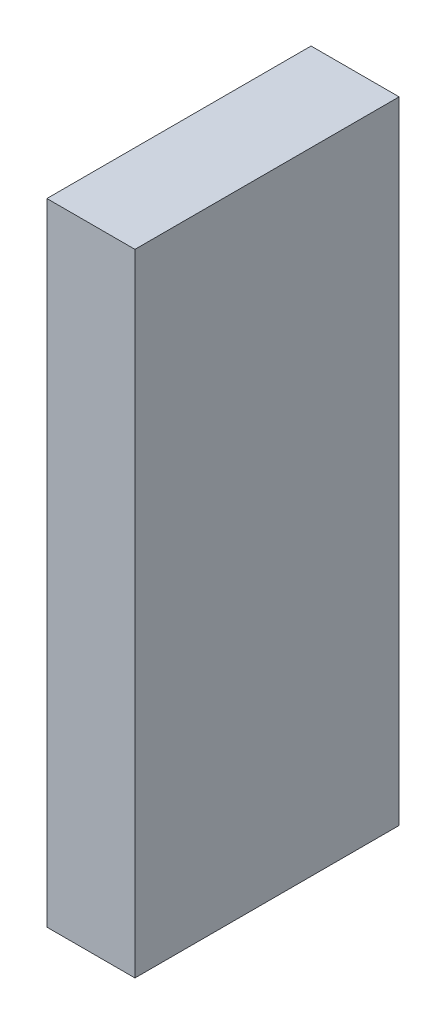
ISO-10303-21;
HEADER;
FILE_DESCRIPTION(('STEP AP214'),'2;1');
FILE_NAME('part.step','',(''),(''),'','','');
FILE_SCHEMA(('AUTOMOTIVE_DESIGN { 1 0 10303 214 1 1 1 1 }'));
ENDSEC;
DATA;
#1=APPLICATION_CONTEXT('core data for automotive mechanical design processes');
#2=APPLICATION_PROTOCOL_DEFINITION('international standard','automotive_design',2000,#1);
#3=PRODUCT_CONTEXT('',#1,'mechanical');
#4=PRODUCT('Part','Part','',(#3));
#5=PRODUCT_RELATED_PRODUCT_CATEGORY('part','',(#4));
#6=PRODUCT_DEFINITION_FORMATION('','',#4);
#7=PRODUCT_DEFINITION_CONTEXT('part definition',#1,'design');
#8=PRODUCT_DEFINITION('design','',#6,#7);
#9=PRODUCT_DEFINITION_SHAPE('','',#8);
#10=(LENGTH_UNIT() NAMED_UNIT(*) SI_UNIT(.MILLI.,.METRE.));
#11=(NAMED_UNIT(*) PLANE_ANGLE_UNIT() SI_UNIT($,.RADIAN.));
#12=(NAMED_UNIT(*) SI_UNIT($,.STERADIAN.) SOLID_ANGLE_UNIT());
#13=UNCERTAINTY_MEASURE_WITH_UNIT(LENGTH_MEASURE(1.E-05),#10,'distance_accuracy_value','');
#14=(GEOMETRIC_REPRESENTATION_CONTEXT(3) GLOBAL_UNCERTAINTY_ASSIGNED_CONTEXT((#13)) GLOBAL_UNIT_ASSIGNED_CONTEXT((#10,
#11,#12)) REPRESENTATION_CONTEXT('',''));
#15=CARTESIAN_POINT('',(0.,0.,0.));
#16=DIRECTION('',(0.,0.,1.));
#17=DIRECTION('',(1.,0.,0.));
#18=AXIS2_PLACEMENT_3D('',#15,#16,#17);
#19=CARTESIAN_POINT('',(15.,107.5,-45.));
#20=DIRECTION('',(-1.,0.,0.));
#21=DIRECTION('',(0.,0.,1.));
#22=AXIS2_PLACEMENT_3D('',#19,#20,#21);
#23=PLANE('',#22);
#24=DIRECTION('',(0.,0.,-1.));
#25=VECTOR('',#24,1.);
#26=CARTESIAN_POINT('',(15.,-107.5,-45.));
#27=LINE('',#26,#25);
#28=CARTESIAN_POINT('',(15.,-107.5,45.));
#29=VERTEX_POINT('',#28);
#30=CARTESIAN_POINT('',(15.,-107.5,-45.));
#31=VERTEX_POINT('',#30);
#32=EDGE_CURVE('E96',#29,#31,#27,.T.);
#33=ORIENTED_EDGE('',*,*,#32,.T.);
#34=DIRECTION('',(0.,-1.,0.));
#35=VECTOR('',#34,1.);
#36=CARTESIAN_POINT('',(15.,107.5,-45.));
#37=LINE('',#36,#35);
#38=CARTESIAN_POINT('',(15.,107.5,-45.));
#39=VERTEX_POINT('',#38);
#40=EDGE_CURVE('E11',#39,#31,#37,.T.);
#41=ORIENTED_EDGE('',*,*,#40,.F.);
#42=DIRECTION('',(0.,0.,-1.));
#43=VECTOR('',#42,1.);
#44=CARTESIAN_POINT('',(15.,107.5,-45.));
#45=LINE('',#44,#43);
#46=CARTESIAN_POINT('',(15.,107.5,45.));
#47=VERTEX_POINT('',#46);
#48=EDGE_CURVE('E84',#47,#39,#45,.T.);
#49=ORIENTED_EDGE('',*,*,#48,.F.);
#50=DIRECTION('',(0.,-1.,0.));
#51=VECTOR('',#50,1.);
#52=CARTESIAN_POINT('',(15.,107.5,45.));
#53=LINE('',#52,#51);
#54=EDGE_CURVE('E92',#47,#29,#53,.T.);
#55=ORIENTED_EDGE('',*,*,#54,.T.);
#56=EDGE_LOOP('',(#33,#41,#49,#55));
#57=FACE_BOUND('',#56,.T.);
#58=ADVANCED_FACE('F33',(#57),#23,.F.);
#59=CARTESIAN_POINT('',(-15.,107.5,-45.));
#60=DIRECTION('',(0.,0.,1.));
#61=DIRECTION('',(1.,0.,0.));
#62=AXIS2_PLACEMENT_3D('',#59,#60,#61);
#63=PLANE('',#62);
#64=DIRECTION('',(-1.,0.,0.));
#65=VECTOR('',#64,1.);
#66=CARTESIAN_POINT('',(-15.,-107.5,-45.));
#67=LINE('',#66,#65);
#68=CARTESIAN_POINT('',(-15.,-107.5,-45.));
#69=VERTEX_POINT('',#68);
#70=EDGE_CURVE('E88',#31,#69,#67,.T.);
#71=ORIENTED_EDGE('',*,*,#70,.T.);
#72=DIRECTION('',(0.,-1.,0.));
#73=VECTOR('',#72,1.);
#74=CARTESIAN_POINT('',(-15.,107.5,-45.));
#75=LINE('',#74,#73);
#76=CARTESIAN_POINT('',(-15.,107.5,-45.));
#77=VERTEX_POINT('',#76);
#78=EDGE_CURVE('E41',#77,#69,#75,.T.);
#79=ORIENTED_EDGE('',*,*,#78,.F.);
#80=DIRECTION('',(-1.,0.,0.));
#81=VECTOR('',#80,1.);
#82=CARTESIAN_POINT('',(-15.,107.5,-45.));
#83=LINE('',#82,#81);
#84=EDGE_CURVE('E79',#39,#77,#83,.T.);
#85=ORIENTED_EDGE('',*,*,#84,.F.);
#86=ORIENTED_EDGE('',*,*,#40,.T.);
#87=EDGE_LOOP('',(#71,#79,#85,#86));
#88=FACE_BOUND('',#87,.T.);
#89=ADVANCED_FACE('F87',(#88),#63,.F.);
#90=CARTESIAN_POINT('',(-15.,107.5,-45.));
#91=DIRECTION('',(1.,0.,0.));
#92=DIRECTION('',(0.,0.,-1.));
#93=AXIS2_PLACEMENT_3D('',#90,#91,#92);
#94=PLANE('',#93);
#95=DIRECTION('',(0.,0.,1.));
#96=VECTOR('',#95,1.);
#97=CARTESIAN_POINT('',(-15.,-107.5,-45.));
#98=LINE('',#97,#96);
#99=CARTESIAN_POINT('',(-15.,-107.5,45.));
#100=VERTEX_POINT('',#99);
#101=EDGE_CURVE('E66',#69,#100,#98,.T.);
#102=ORIENTED_EDGE('',*,*,#101,.T.);
#103=DIRECTION('',(0.,-1.,0.));
#104=VECTOR('',#103,1.);
#105=CARTESIAN_POINT('',(-15.,107.5,45.));
#106=LINE('',#105,#104);
#107=CARTESIAN_POINT('',(-15.,107.5,45.));
#108=VERTEX_POINT('',#107);
#109=EDGE_CURVE('E89',#108,#100,#106,.T.);
#110=ORIENTED_EDGE('',*,*,#109,.F.);
#111=DIRECTION('',(0.,0.,1.));
#112=VECTOR('',#111,1.);
#113=CARTESIAN_POINT('',(-15.,107.5,-45.));
#114=LINE('',#113,#112);
#115=EDGE_CURVE('E82',#77,#108,#114,.T.);
#116=ORIENTED_EDGE('',*,*,#115,.F.);
#117=ORIENTED_EDGE('',*,*,#78,.T.);
#118=EDGE_LOOP('',(#102,#110,#116,#117));
#119=FACE_BOUND('',#118,.T.);
#120=ADVANCED_FACE('F90',(#119),#94,.F.);
#121=CARTESIAN_POINT('',(-15.,107.5,45.));
#122=DIRECTION('',(0.,0.,-1.));
#123=DIRECTION('',(-1.,0.,0.));
#124=AXIS2_PLACEMENT_3D('',#121,#122,#123);
#125=PLANE('',#124);
#126=DIRECTION('',(1.,0.,0.));
#127=VECTOR('',#126,1.);
#128=CARTESIAN_POINT('',(-15.,-107.5,45.));
#129=LINE('',#128,#127);
#130=EDGE_CURVE('E72',#100,#29,#129,.T.);
#131=ORIENTED_EDGE('',*,*,#130,.T.);
#132=ORIENTED_EDGE('',*,*,#54,.F.);
#133=DIRECTION('',(1.,0.,0.));
#134=VECTOR('',#133,1.);
#135=CARTESIAN_POINT('',(-15.,107.5,45.));
#136=LINE('',#135,#134);
#137=EDGE_CURVE('E49',#108,#47,#136,.T.);
#138=ORIENTED_EDGE('',*,*,#137,.F.);
#139=ORIENTED_EDGE('',*,*,#109,.T.);
#140=EDGE_LOOP('',(#131,#132,#138,#139));
#141=FACE_BOUND('',#140,.T.);
#142=ADVANCED_FACE('F103',(#141),#125,.F.);
#143=CARTESIAN_POINT('',(0.,107.5,0.));
#144=DIRECTION('',(0.,1.,0.));
#145=DIRECTION('',(0.,0.,1.));
#146=AXIS2_PLACEMENT_3D('',#143,#144,#145);
#147=PLANE('',#146);
#148=ORIENTED_EDGE('',*,*,#48,.T.);
#149=ORIENTED_EDGE('',*,*,#84,.T.);
#150=ORIENTED_EDGE('',*,*,#115,.T.);
#151=ORIENTED_EDGE('',*,*,#137,.T.);
#152=EDGE_LOOP('',(#148,#149,#150,#151));
#153=FACE_BOUND('',#152,.T.);
#154=ADVANCED_FACE('F80',(#153),#147,.T.);
#155=CARTESIAN_POINT('',(0.,-107.5,0.));
#156=DIRECTION('',(0.,1.,0.));
#157=DIRECTION('',(0.,0.,1.));
#158=AXIS2_PLACEMENT_3D('',#155,#156,#157);
#159=PLANE('',#158);
#160=ORIENTED_EDGE('',*,*,#32,.F.);
#161=ORIENTED_EDGE('',*,*,#130,.F.);
#162=ORIENTED_EDGE('',*,*,#101,.F.);
#163=ORIENTED_EDGE('',*,*,#70,.F.);
#164=EDGE_LOOP('',(#160,#161,#162,#163));
#165=FACE_BOUND('',#164,.T.);
#166=ADVANCED_FACE('F106',(#165),#159,.F.);
#167=CLOSED_SHELL('',(#58,#89,#120,#142,#154,#166));
#168=MANIFOLD_SOLID_BREP('B2',#167);
#169=ADVANCED_BREP_SHAPE_REPRESENTATION('',(#18,#168),#14);
#170=SHAPE_DEFINITION_REPRESENTATION(#9,#169);
ENDSEC;
END-ISO-10303-21;
